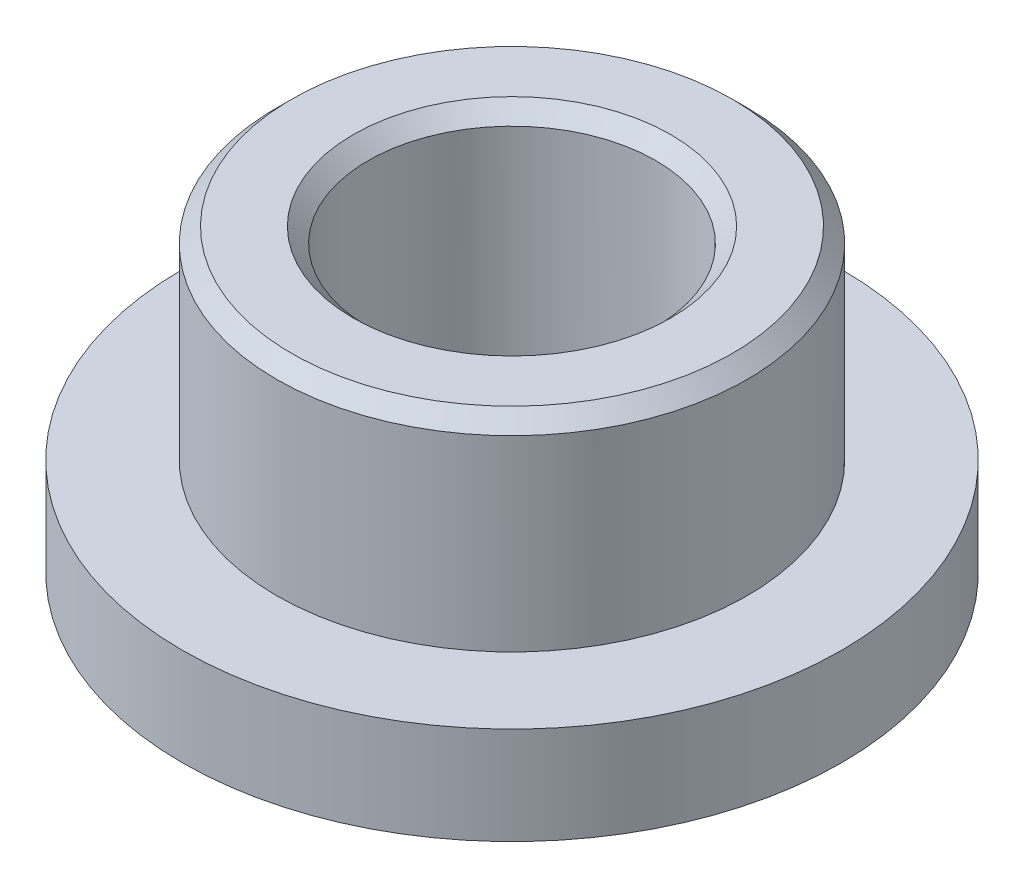
ISO-10303-21;
HEADER;
FILE_DESCRIPTION(('STEP AP214'),'2;1');
FILE_NAME('part.step','',(''),(''),'','','');
FILE_SCHEMA(('AUTOMOTIVE_DESIGN { 1 0 10303 214 1 1 1 1 }'));
ENDSEC;
DATA;
#1=APPLICATION_CONTEXT('core data for automotive mechanical design processes');
#2=APPLICATION_PROTOCOL_DEFINITION('international standard','automotive_design',2000,#1);
#3=PRODUCT_CONTEXT('',#1,'mechanical');
#4=PRODUCT('Part','Part','',(#3));
#5=PRODUCT_RELATED_PRODUCT_CATEGORY('part','',(#4));
#6=PRODUCT_DEFINITION_FORMATION('','',#4);
#7=PRODUCT_DEFINITION_CONTEXT('part definition',#1,'design');
#8=PRODUCT_DEFINITION('design','',#6,#7);
#9=PRODUCT_DEFINITION_SHAPE('','',#8);
#10=(LENGTH_UNIT() NAMED_UNIT(*) SI_UNIT(.MILLI.,.METRE.));
#11=(NAMED_UNIT(*) PLANE_ANGLE_UNIT() SI_UNIT($,.RADIAN.));
#12=(NAMED_UNIT(*) SI_UNIT($,.STERADIAN.) SOLID_ANGLE_UNIT());
#13=UNCERTAINTY_MEASURE_WITH_UNIT(LENGTH_MEASURE(1.E-05),#10,'distance_accuracy_value','');
#14=(GEOMETRIC_REPRESENTATION_CONTEXT(3) GLOBAL_UNCERTAINTY_ASSIGNED_CONTEXT((#13)) GLOBAL_UNIT_ASSIGNED_CONTEXT((#10,
#11,#12)) REPRESENTATION_CONTEXT('',''));
#15=CARTESIAN_POINT('',(0.,0.,0.));
#16=DIRECTION('',(0.,0.,1.));
#17=DIRECTION('',(1.,0.,0.));
#18=AXIS2_PLACEMENT_3D('',#15,#16,#17);
#19=CARTESIAN_POINT('',(5.5,1.62560000005684,0.));
#20=DIRECTION('',(0.,-1.,0.));
#21=DIRECTION('',(0.,0.,-1.));
#22=AXIS2_PLACEMENT_3D('',#19,#20,#21);
#23=PLANE('',#22);
#24=CARTESIAN_POINT('',(0.,1.62560000005684,0.));
#25=DIRECTION('',(0.,1.,0.));
#26=DIRECTION('',(0.,0.,1.));
#27=AXIS2_PLACEMENT_3D('',#24,#25,#26);
#28=CIRCLE('',#27,3.92500000001473);
#29=CARTESIAN_POINT('',(0.,1.62560000005684,3.92500000001473));
#30=VERTEX_POINT('',#29);
#31=EDGE_CURVE('E63',#30,#30,#28,.T.);
#32=ORIENTED_EDGE('',*,*,#31,.F.);
#33=EDGE_LOOP('',(#32));
#34=FACE_BOUND('',#33,.T.);
#35=CARTESIAN_POINT('',(0.,1.62560000005684,0.));
#36=DIRECTION('',(0.,1.,0.));
#37=DIRECTION('',(0.,0.,1.));
#38=AXIS2_PLACEMENT_3D('',#35,#36,#37);
#39=CIRCLE('',#38,5.5);
#40=CARTESIAN_POINT('',(0.,1.62560000005684,5.5));
#41=VERTEX_POINT('',#40);
#42=EDGE_CURVE('E51',#41,#41,#39,.T.);
#43=ORIENTED_EDGE('',*,*,#42,.T.);
#44=EDGE_LOOP('',(#43));
#45=FACE_BOUND('',#44,.T.);
#46=ADVANCED_FACE('F31',(#34,#45),#23,.F.);
#47=CARTESIAN_POINT('',(0.,0.,0.));
#48=DIRECTION('',(0.,1.,0.));
#49=DIRECTION('',(0.,0.,1.));
#50=AXIS2_PLACEMENT_3D('',#47,#48,#49);
#51=CYLINDRICAL_SURFACE('',#50,5.5);
#52=ORIENTED_EDGE('',*,*,#42,.F.);
#53=EDGE_LOOP('',(#52));
#54=FACE_BOUND('',#53,.T.);
#55=CARTESIAN_POINT('',(0.,5.68434763593111E-11,0.));
#56=DIRECTION('',(0.,1.,0.));
#57=DIRECTION('',(0.,0.,1.));
#58=AXIS2_PLACEMENT_3D('',#55,#56,#57);
#59=CIRCLE('',#58,5.5);
#60=CARTESIAN_POINT('',(0.,5.68434763593111E-11,5.5));
#61=VERTEX_POINT('',#60);
#62=EDGE_CURVE('E54',#61,#61,#59,.T.);
#63=ORIENTED_EDGE('',*,*,#62,.T.);
#64=EDGE_LOOP('',(#63));
#65=FACE_BOUND('',#64,.T.);
#66=ADVANCED_FACE('F71',(#54,#65),#51,.T.);
#67=CARTESIAN_POINT('',(5.5,5.68434476100596E-11,0.));
#68=DIRECTION('',(0.,1.,0.));
#69=DIRECTION('',(0.,0.,1.));
#70=AXIS2_PLACEMENT_3D('',#67,#68,#69);
#71=PLANE('',#70);
#72=ORIENTED_EDGE('',*,*,#62,.F.);
#73=EDGE_LOOP('',(#72));
#74=FACE_BOUND('',#73,.T.);
#75=CARTESIAN_POINT('',(0.,5.6843418860808E-11,0.));
#76=DIRECTION('',(0.,1.,0.));
#77=DIRECTION('',(0.,0.,1.));
#78=AXIS2_PLACEMENT_3D('',#75,#76,#77);
#79=CIRCLE('',#78,2.59999999997262);
#80=CARTESIAN_POINT('',(0.,5.6843418860808E-11,2.59999999997262));
#81=VERTEX_POINT('',#80);
#82=EDGE_CURVE('E57',#81,#81,#79,.T.);
#83=ORIENTED_EDGE('',*,*,#82,.T.);
#84=EDGE_LOOP('',(#83));
#85=FACE_BOUND('',#84,.T.);
#86=ADVANCED_FACE('F77',(#74,#85),#71,.F.);
#87=CARTESIAN_POINT('',(0.,0.200000000014732,0.));
#88=DIRECTION('',(0.,-1.,0.));
#89=DIRECTION('',(0.,0.,-1.));
#90=AXIS2_PLACEMENT_3D('',#87,#88,#89);
#91=CONICAL_SURFACE('',#90,2.40000000001473,0.785398163397448);
#92=ORIENTED_EDGE('',*,*,#82,.F.);
#93=EDGE_LOOP('',(#92));
#94=FACE_BOUND('',#93,.T.);
#95=CARTESIAN_POINT('',(0.,0.200000000014732,0.));
#96=DIRECTION('',(0.,1.,0.));
#97=DIRECTION('',(0.,0.,1.));
#98=AXIS2_PLACEMENT_3D('',#95,#96,#97);
#99=CIRCLE('',#98,2.40000000001473);
#100=CARTESIAN_POINT('',(0.,0.200000000014732,2.40000000001473));
#101=VERTEX_POINT('',#100);
#102=EDGE_CURVE('E60',#101,#101,#99,.T.);
#103=ORIENTED_EDGE('',*,*,#102,.T.);
#104=EDGE_LOOP('',(#103));
#105=FACE_BOUND('',#104,.T.);
#106=ADVANCED_FACE('F83',(#94,#105),#91,.F.);
#107=CARTESIAN_POINT('',(0.,0.,0.));
#108=DIRECTION('',(0.,1.,0.));
#109=DIRECTION('',(0.,0.,1.));
#110=AXIS2_PLACEMENT_3D('',#107,#108,#109);
#111=CYLINDRICAL_SURFACE('',#110,2.40000000001473);
#112=CARTESIAN_POINT('',(0.,4.75000000005685,0.));
#113=DIRECTION('',(0.,-1.,0.));
#114=DIRECTION('',(0.,0.,-1.));
#115=AXIS2_PLACEMENT_3D('',#112,#113,#114);
#116=CIRCLE('',#115,2.40000000001473);
#117=CARTESIAN_POINT('',(0.,4.75000000005685,-2.40000000001473));
#118=VERTEX_POINT('',#117);
#119=EDGE_CURVE('E46',#118,#118,#116,.F.);
#120=ORIENTED_EDGE('',*,*,#119,.T.);
#121=EDGE_LOOP('',(#120));
#122=FACE_BOUND('',#121,.T.);
#123=ORIENTED_EDGE('',*,*,#102,.F.);
#124=EDGE_LOOP('',(#123));
#125=FACE_BOUND('',#124,.T.);
#126=ADVANCED_FACE('F89',(#122,#125),#111,.F.);
#127=CARTESIAN_POINT('',(0.,0.,0.));
#128=DIRECTION('',(0.,1.,0.));
#129=DIRECTION('',(0.,0.,1.));
#130=AXIS2_PLACEMENT_3D('',#127,#128,#129);
#131=CYLINDRICAL_SURFACE('',#130,3.92500000001473);
#132=CARTESIAN_POINT('',(0.,4.75000000005685,0.));
#133=DIRECTION('',(0.,-1.,0.));
#134=DIRECTION('',(0.,0.,-1.));
#135=AXIS2_PLACEMENT_3D('',#132,#133,#134);
#136=CIRCLE('',#135,3.92500000001473);
#137=CARTESIAN_POINT('',(0.,4.75000000005685,-3.92500000001473));
#138=VERTEX_POINT('',#137);
#139=EDGE_CURVE('E10',#138,#138,#136,.T.);
#140=ORIENTED_EDGE('',*,*,#139,.T.);
#141=EDGE_LOOP('',(#140));
#142=FACE_BOUND('',#141,.T.);
#143=ORIENTED_EDGE('',*,*,#31,.T.);
#144=EDGE_LOOP('',(#143));
#145=FACE_BOUND('',#144,.T.);
#146=ADVANCED_FACE('F67',(#142,#145),#131,.T.);
#147=CARTESIAN_POINT('',(-7.,5.00000000005684,-5.5));
#148=DIRECTION('',(0.,-1.,0.));
#149=DIRECTION('',(0.,0.,-1.));
#150=AXIS2_PLACEMENT_3D('',#147,#148,#149);
#151=PLANE('',#150);
#152=CARTESIAN_POINT('',(0.,5.00000000005684,0.));
#153=DIRECTION('',(0.,-1.,0.));
#154=DIRECTION('',(0.,0.,-1.));
#155=AXIS2_PLACEMENT_3D('',#152,#153,#154);
#156=CIRCLE('',#155,2.65000000001473);
#157=CARTESIAN_POINT('',(0.,5.00000000005684,-2.65000000001473));
#158=VERTEX_POINT('',#157);
#159=EDGE_CURVE('E38',#158,#158,#156,.T.);
#160=ORIENTED_EDGE('',*,*,#159,.T.);
#161=EDGE_LOOP('',(#160));
#162=FACE_BOUND('',#161,.T.);
#163=CARTESIAN_POINT('',(0.,5.00000000005684,0.));
#164=DIRECTION('',(0.,-1.,0.));
#165=DIRECTION('',(0.,0.,-1.));
#166=AXIS2_PLACEMENT_3D('',#163,#164,#165);
#167=CIRCLE('',#166,3.67500000001473);
#168=CARTESIAN_POINT('',(0.,5.00000000005684,-3.67500000001473));
#169=VERTEX_POINT('',#168);
#170=EDGE_CURVE('E42',#169,#169,#167,.F.);
#171=ORIENTED_EDGE('',*,*,#170,.T.);
#172=EDGE_LOOP('',(#171));
#173=FACE_BOUND('',#172,.T.);
#174=ADVANCED_FACE('F99',(#162,#173),#151,.F.);
#175=CARTESIAN_POINT('',(0.,4.75000000005685,0.));
#176=DIRECTION('',(0.,1.,0.));
#177=DIRECTION('',(0.,0.,1.));
#178=AXIS2_PLACEMENT_3D('',#175,#176,#177);
#179=CONICAL_SURFACE('',#178,2.40000000001473,0.785398163397453);
#180=ORIENTED_EDGE('',*,*,#159,.F.);
#181=EDGE_LOOP('',(#180));
#182=FACE_BOUND('',#181,.T.);
#183=ORIENTED_EDGE('',*,*,#119,.F.);
#184=EDGE_LOOP('',(#183));
#185=FACE_BOUND('',#184,.T.);
#186=ADVANCED_FACE('F102',(#182,#185),#179,.F.);
#187=CARTESIAN_POINT('',(0.,4.75000000005685,0.));
#188=DIRECTION('',(0.,-1.,0.));
#189=DIRECTION('',(0.,0.,-1.));
#190=AXIS2_PLACEMENT_3D('',#187,#188,#189);
#191=CONICAL_SURFACE('',#190,3.92500000001473,0.785398163397452);
#192=ORIENTED_EDGE('',*,*,#170,.F.);
#193=EDGE_LOOP('',(#192));
#194=FACE_BOUND('',#193,.T.);
#195=ORIENTED_EDGE('',*,*,#139,.F.);
#196=EDGE_LOOP('',(#195));
#197=FACE_BOUND('',#196,.T.);
#198=ADVANCED_FACE('F33',(#194,#197),#191,.T.);
#199=CLOSED_SHELL('',(#46,#66,#86,#106,#126,#146,#174,#186,#198));
#200=MANIFOLD_SOLID_BREP('B2',#199);
#201=ADVANCED_BREP_SHAPE_REPRESENTATION('',(#18,#200),#14);
#202=SHAPE_DEFINITION_REPRESENTATION(#9,#201);
ENDSEC;
END-ISO-10303-21;
